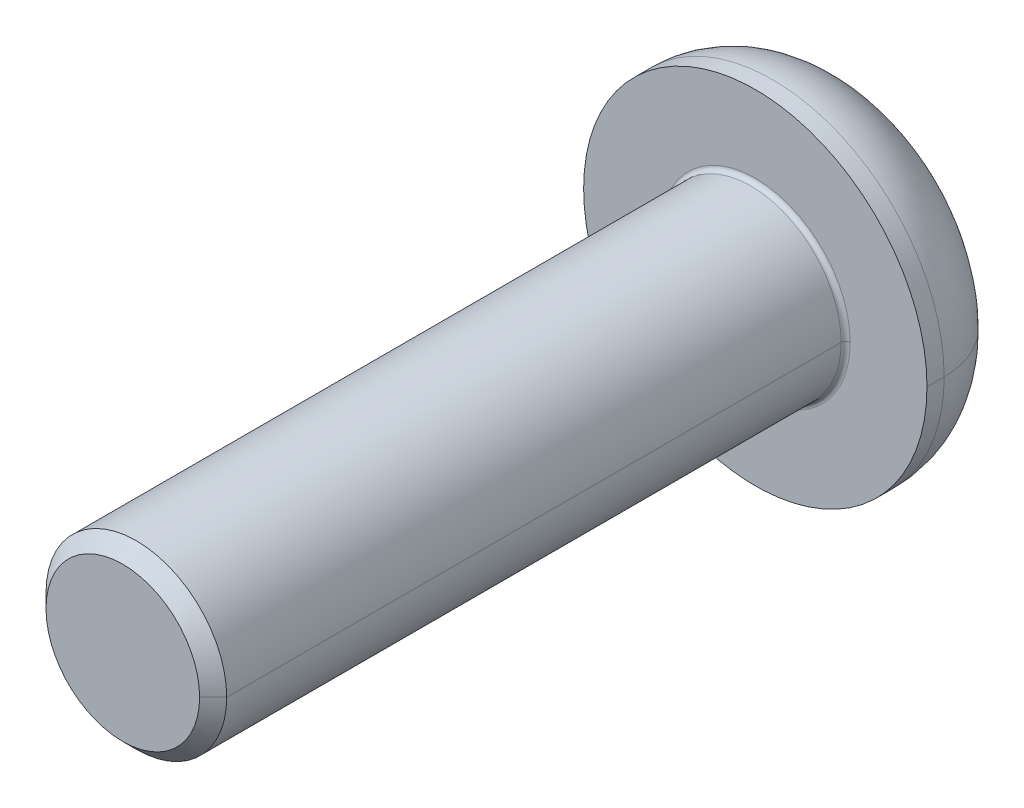
ISO-10303-21;
HEADER;
FILE_DESCRIPTION(('STEP AP214'),'2;1');
FILE_NAME('part.step','',(''),(''),'','','');
FILE_SCHEMA(('AUTOMOTIVE_DESIGN { 1 0 10303 214 1 1 1 1 }'));
ENDSEC;
DATA;
#1=APPLICATION_CONTEXT('core data for automotive mechanical design processes');
#2=APPLICATION_PROTOCOL_DEFINITION('international standard','automotive_design',2000,#1);
#3=PRODUCT_CONTEXT('',#1,'mechanical');
#4=PRODUCT('Part','Part','',(#3));
#5=PRODUCT_RELATED_PRODUCT_CATEGORY('part','',(#4));
#6=PRODUCT_DEFINITION_FORMATION('','',#4);
#7=PRODUCT_DEFINITION_CONTEXT('part definition',#1,'design');
#8=PRODUCT_DEFINITION('design','',#6,#7);
#9=PRODUCT_DEFINITION_SHAPE('','',#8);
#10=(LENGTH_UNIT() NAMED_UNIT(*) SI_UNIT(.MILLI.,.METRE.));
#11=(NAMED_UNIT(*) PLANE_ANGLE_UNIT() SI_UNIT($,.RADIAN.));
#12=(NAMED_UNIT(*) SI_UNIT($,.STERADIAN.) SOLID_ANGLE_UNIT());
#13=UNCERTAINTY_MEASURE_WITH_UNIT(LENGTH_MEASURE(1.E-05),#10,'distance_accuracy_value','');
#14=(GEOMETRIC_REPRESENTATION_CONTEXT(3) GLOBAL_UNCERTAINTY_ASSIGNED_CONTEXT((#13)) GLOBAL_UNIT_ASSIGNED_CONTEXT((#10,
#11,#12)) REPRESENTATION_CONTEXT('',''));
#15=CARTESIAN_POINT('',(0.,0.,0.));
#16=DIRECTION('',(0.,0.,1.));
#17=DIRECTION('',(1.,0.,0.));
#18=AXIS2_PLACEMENT_3D('',#15,#16,#17);
#19=CARTESIAN_POINT('',(0.,0.,0.1));
#20=DIRECTION('',(0.,0.,-1.));
#21=DIRECTION('',(-1.,0.,0.));
#22=AXIS2_PLACEMENT_3D('',#19,#20,#21);
#23=TOROIDAL_SURFACE('',#22,2.1,0.1);
#24=CARTESIAN_POINT('',(2.1,0.,0.1));
#25=DIRECTION('',(0.,1.,0.));
#26=DIRECTION('',(-1.,0.,0.));
#27=AXIS2_PLACEMENT_3D('',#24,#25,#26);
#28=CIRCLE('',#27,0.1);
#29=CARTESIAN_POINT('',(2.1,0.,0.));
#30=VERTEX_POINT('',#29);
#31=CARTESIAN_POINT('',(2.,0.,0.1));
#32=VERTEX_POINT('',#31);
#33=EDGE_CURVE('E296',#30,#32,#28,.T.);
#34=ORIENTED_EDGE('',*,*,#33,.F.);
#35=CARTESIAN_POINT('',(0.,0.,0.));
#36=DIRECTION('',(0.,0.,-1.));
#37=DIRECTION('',(-1.,0.,0.));
#38=AXIS2_PLACEMENT_3D('',#35,#36,#37);
#39=CIRCLE('',#38,2.1);
#40=CARTESIAN_POINT('',(-2.1,0.,0.));
#41=VERTEX_POINT('',#40);
#42=EDGE_CURVE('E232',#41,#30,#39,.T.);
#43=ORIENTED_EDGE('',*,*,#42,.F.);
#44=CARTESIAN_POINT('',(-2.1,0.,0.1));
#45=DIRECTION('',(0.,-1.,0.));
#46=DIRECTION('',(0.,0.,-1.));
#47=AXIS2_PLACEMENT_3D('',#44,#45,#46);
#48=CIRCLE('',#47,0.1);
#49=CARTESIAN_POINT('',(-2.,0.,0.1));
#50=VERTEX_POINT('',#49);
#51=EDGE_CURVE('E309',#41,#50,#48,.T.);
#52=ORIENTED_EDGE('',*,*,#51,.T.);
#53=CARTESIAN_POINT('',(0.,0.,0.1));
#54=DIRECTION('',(0.,0.,1.));
#55=DIRECTION('',(-1.,0.,0.));
#56=AXIS2_PLACEMENT_3D('',#53,#54,#55);
#57=CIRCLE('',#56,2.);
#58=EDGE_CURVE('E189',#32,#50,#57,.T.);
#59=ORIENTED_EDGE('',*,*,#58,.F.);
#60=EDGE_LOOP('',(#34,#43,#52,#59));
#61=FACE_BOUND('',#60,.T.);
#62=ADVANCED_FACE('F17',(#61),#23,.F.);
#63=CARTESIAN_POINT('',(0.,0.,-0.38));
#64=DIRECTION('',(0.,0.,-1.));
#65=DIRECTION('',(-1.,0.,0.));
#66=AXIS2_PLACEMENT_3D('',#63,#64,#65);
#67=TOROIDAL_SURFACE('',#66,1.98,1.82);
#68=CARTESIAN_POINT('',(1.98,0.,-0.38));
#69=DIRECTION('',(0.,1.,0.));
#70=DIRECTION('',(-1.,0.,0.));
#71=AXIS2_PLACEMENT_3D('',#68,#69,#70);
#72=CIRCLE('',#71,1.82);
#73=CARTESIAN_POINT('',(3.8,0.,-0.38));
#74=VERTEX_POINT('',#73);
#75=CARTESIAN_POINT('',(1.98,0.,-2.2));
#76=VERTEX_POINT('',#75);
#77=EDGE_CURVE('E314',#74,#76,#72,.T.);
#78=ORIENTED_EDGE('',*,*,#77,.F.);
#79=CARTESIAN_POINT('',(0.,0.,-0.38));
#80=DIRECTION('',(0.,0.,1.));
#81=DIRECTION('',(-1.,0.,0.));
#82=AXIS2_PLACEMENT_3D('',#79,#80,#81);
#83=CIRCLE('',#82,3.8);
#84=CARTESIAN_POINT('',(-3.8,0.,-0.38));
#85=VERTEX_POINT('',#84);
#86=EDGE_CURVE('E156',#85,#74,#83,.T.);
#87=ORIENTED_EDGE('',*,*,#86,.F.);
#88=CARTESIAN_POINT('',(-1.98,0.,-0.38));
#89=DIRECTION('',(0.,-1.,0.));
#90=DIRECTION('',(0.,0.,-1.));
#91=AXIS2_PLACEMENT_3D('',#88,#89,#90);
#92=CIRCLE('',#91,1.82);
#93=CARTESIAN_POINT('',(-1.98,0.,-2.2));
#94=VERTEX_POINT('',#93);
#95=EDGE_CURVE('E182',#85,#94,#92,.T.);
#96=ORIENTED_EDGE('',*,*,#95,.T.);
#97=CARTESIAN_POINT('',(0.,0.,-2.2));
#98=DIRECTION('',(0.,0.,-1.));
#99=DIRECTION('',(-1.,0.,0.));
#100=AXIS2_PLACEMENT_3D('',#97,#98,#99);
#101=CIRCLE('',#100,1.98);
#102=EDGE_CURVE('E204',#76,#94,#101,.T.);
#103=ORIENTED_EDGE('',*,*,#102,.F.);
#104=EDGE_LOOP('',(#78,#87,#96,#103));
#105=FACE_BOUND('',#104,.T.);
#106=ADVANCED_FACE('F340',(#105),#67,.T.);
#107=CARTESIAN_POINT('',(0.,0.,-0.9));
#108=DIRECTION('',(0.,0.,-1.));
#109=DIRECTION('',(0.,-1.,0.));
#110=AXIS2_PLACEMENT_3D('',#107,#108,#109);
#111=PLANE('',#110);
#112=DIRECTION('',(-1.,0.,0.));
#113=VECTOR('',#112,1.);
#114=CARTESIAN_POINT('',(0.721687836487032,-1.25,-0.9));
#115=LINE('',#114,#113);
#116=CARTESIAN_POINT('',(0.721687836487032,-1.25,-0.9));
#117=VERTEX_POINT('',#116);
#118=CARTESIAN_POINT('',(-0.721687836487032,-1.25,-0.9));
#119=VERTEX_POINT('',#118);
#120=EDGE_CURVE('E194',#117,#119,#115,.T.);
#121=ORIENTED_EDGE('',*,*,#120,.T.);
#122=DIRECTION('',(-0.5,0.866025403784439,0.));
#123=VECTOR('',#122,1.);
#124=CARTESIAN_POINT('',(-0.721687836487032,-1.25,-0.9));
#125=LINE('',#124,#123);
#126=CARTESIAN_POINT('',(-1.44337567297406,0.,-0.9));
#127=VERTEX_POINT('',#126);
#128=EDGE_CURVE('E11',#119,#127,#125,.T.);
#129=ORIENTED_EDGE('',*,*,#128,.T.);
#130=DIRECTION('',(0.5,0.866025403784439,0.));
#131=VECTOR('',#130,1.);
#132=CARTESIAN_POINT('',(-1.44337567297406,0.,-0.9));
#133=LINE('',#132,#131);
#134=CARTESIAN_POINT('',(-0.721687836487033,1.25,-0.9));
#135=VERTEX_POINT('',#134);
#136=EDGE_CURVE('E45',#127,#135,#133,.T.);
#137=ORIENTED_EDGE('',*,*,#136,.T.);
#138=DIRECTION('',(1.,0.,0.));
#139=VECTOR('',#138,1.);
#140=CARTESIAN_POINT('',(-0.721687836487033,1.25,-0.9));
#141=LINE('',#140,#139);
#142=CARTESIAN_POINT('',(0.721687836487032,1.25,-0.9));
#143=VERTEX_POINT('',#142);
#144=EDGE_CURVE('E246',#135,#143,#141,.T.);
#145=ORIENTED_EDGE('',*,*,#144,.T.);
#146=DIRECTION('',(0.5,-0.866025403784439,0.));
#147=VECTOR('',#146,1.);
#148=CARTESIAN_POINT('',(0.721687836487032,1.25,-0.9));
#149=LINE('',#148,#147);
#150=CARTESIAN_POINT('',(1.44337567297406,0.,-0.9));
#151=VERTEX_POINT('',#150);
#152=EDGE_CURVE('E240',#143,#151,#149,.T.);
#153=ORIENTED_EDGE('',*,*,#152,.T.);
#154=DIRECTION('',(-0.5,-0.866025403784439,0.));
#155=VECTOR('',#154,1.);
#156=CARTESIAN_POINT('',(1.44337567297406,0.,-0.9));
#157=LINE('',#156,#155);
#158=EDGE_CURVE('E208',#151,#117,#157,.T.);
#159=ORIENTED_EDGE('',*,*,#158,.T.);
#160=EDGE_LOOP('',(#121,#129,#137,#145,#153,#159));
#161=FACE_BOUND('',#160,.T.);
#162=ADVANCED_FACE('F276',(#161),#111,.T.);
#163=CARTESIAN_POINT('',(-0.721687836487032,-1.25,-0.9));
#164=DIRECTION('',(-0.866025403784439,-0.5,0.));
#165=DIRECTION('',(-0.5,0.866025403784439,0.));
#166=AXIS2_PLACEMENT_3D('',#163,#164,#165);
#167=PLANE('',#166);
#168=DIRECTION('',(-0.5,0.866025403784439,0.));
#169=VECTOR('',#168,1.);
#170=CARTESIAN_POINT('',(-0.721687836487032,-1.25,-2.2));
#171=LINE('',#170,#169);
#172=CARTESIAN_POINT('',(-0.721687836487032,-1.25,-2.2));
#173=VERTEX_POINT('',#172);
#174=CARTESIAN_POINT('',(-1.44337567297406,0.,-2.2));
#175=VERTEX_POINT('',#174);
#176=EDGE_CURVE('E228',#173,#175,#171,.T.);
#177=ORIENTED_EDGE('',*,*,#176,.T.);
#178=DIRECTION('',(0.,0.,-1.));
#179=VECTOR('',#178,1.);
#180=CARTESIAN_POINT('',(-1.44337567297406,0.,-0.9));
#181=LINE('',#180,#179);
#182=EDGE_CURVE('E20',#127,#175,#181,.T.);
#183=ORIENTED_EDGE('',*,*,#182,.F.);
#184=ORIENTED_EDGE('',*,*,#128,.F.);
#185=DIRECTION('',(0.,0.,-1.));
#186=VECTOR('',#185,1.);
#187=CARTESIAN_POINT('',(-0.721687836487032,-1.25,-0.9));
#188=LINE('',#187,#186);
#189=EDGE_CURVE('E198',#119,#173,#188,.T.);
#190=ORIENTED_EDGE('',*,*,#189,.T.);
#191=EDGE_LOOP('',(#177,#183,#184,#190));
#192=FACE_BOUND('',#191,.T.);
#193=ADVANCED_FACE('F263',(#192),#167,.F.);
#194=CARTESIAN_POINT('',(-1.44337567297406,0.,-0.9));
#195=DIRECTION('',(-0.866025403784439,0.5,0.));
#196=DIRECTION('',(0.,0.,1.));
#197=AXIS2_PLACEMENT_3D('',#194,#195,#196);
#198=PLANE('',#197);
#199=DIRECTION('',(0.5,0.866025403784439,0.));
#200=VECTOR('',#199,1.);
#201=CARTESIAN_POINT('',(-1.44337567297406,0.,-2.2));
#202=LINE('',#201,#200);
#203=CARTESIAN_POINT('',(-0.721687836487033,1.25,-2.2));
#204=VERTEX_POINT('',#203);
#205=EDGE_CURVE('E224',#175,#204,#202,.T.);
#206=ORIENTED_EDGE('',*,*,#205,.T.);
#207=DIRECTION('',(0.,0.,-1.));
#208=VECTOR('',#207,1.);
#209=CARTESIAN_POINT('',(-0.721687836487033,1.25,-0.9));
#210=LINE('',#209,#208);
#211=EDGE_CURVE('E249',#135,#204,#210,.T.);
#212=ORIENTED_EDGE('',*,*,#211,.F.);
#213=ORIENTED_EDGE('',*,*,#136,.F.);
#214=ORIENTED_EDGE('',*,*,#182,.T.);
#215=EDGE_LOOP('',(#206,#212,#213,#214));
#216=FACE_BOUND('',#215,.T.);
#217=ADVANCED_FACE('F258',(#216),#198,.F.);
#218=CARTESIAN_POINT('',(-0.721687836487033,1.25,-0.9));
#219=DIRECTION('',(0.,1.,0.));
#220=DIRECTION('',(1.,0.,0.));
#221=AXIS2_PLACEMENT_3D('',#218,#219,#220);
#222=PLANE('',#221);
#223=DIRECTION('',(1.,0.,0.));
#224=VECTOR('',#223,1.);
#225=CARTESIAN_POINT('',(-0.721687836487033,1.25,-2.2));
#226=LINE('',#225,#224);
#227=CARTESIAN_POINT('',(0.721687836487032,1.25,-2.2));
#228=VERTEX_POINT('',#227);
#229=EDGE_CURVE('E220',#204,#228,#226,.T.);
#230=ORIENTED_EDGE('',*,*,#229,.T.);
#231=DIRECTION('',(0.,0.,-1.));
#232=VECTOR('',#231,1.);
#233=CARTESIAN_POINT('',(0.721687836487032,1.25,-0.9));
#234=LINE('',#233,#232);
#235=EDGE_CURVE('E243',#143,#228,#234,.T.);
#236=ORIENTED_EDGE('',*,*,#235,.F.);
#237=ORIENTED_EDGE('',*,*,#144,.F.);
#238=ORIENTED_EDGE('',*,*,#211,.T.);
#239=EDGE_LOOP('',(#230,#236,#237,#238));
#240=FACE_BOUND('',#239,.T.);
#241=ADVANCED_FACE('F273',(#240),#222,.F.);
#242=CARTESIAN_POINT('',(0.721687836487032,1.25,-0.9));
#243=DIRECTION('',(0.866025403784439,0.5,0.));
#244=DIRECTION('',(0.,0.,-1.));
#245=AXIS2_PLACEMENT_3D('',#242,#243,#244);
#246=PLANE('',#245);
#247=DIRECTION('',(0.5,-0.866025403784439,0.));
#248=VECTOR('',#247,1.);
#249=CARTESIAN_POINT('',(0.721687836487032,1.25,-2.2));
#250=LINE('',#249,#248);
#251=CARTESIAN_POINT('',(1.44337567297406,0.,-2.2));
#252=VERTEX_POINT('',#251);
#253=EDGE_CURVE('E216',#228,#252,#250,.T.);
#254=ORIENTED_EDGE('',*,*,#253,.T.);
#255=DIRECTION('',(0.,0.,-1.));
#256=VECTOR('',#255,1.);
#257=CARTESIAN_POINT('',(1.44337567297406,0.,-0.9));
#258=LINE('',#257,#256);
#259=EDGE_CURVE('E237',#151,#252,#258,.T.);
#260=ORIENTED_EDGE('',*,*,#259,.F.);
#261=ORIENTED_EDGE('',*,*,#152,.F.);
#262=ORIENTED_EDGE('',*,*,#235,.T.);
#263=EDGE_LOOP('',(#254,#260,#261,#262));
#264=FACE_BOUND('',#263,.T.);
#265=ADVANCED_FACE('F281',(#264),#246,.F.);
#266=CARTESIAN_POINT('',(1.44337567297406,0.,-0.9));
#267=DIRECTION('',(0.866025403784439,-0.5,0.));
#268=DIRECTION('',(0.,0.,-1.));
#269=AXIS2_PLACEMENT_3D('',#266,#267,#268);
#270=PLANE('',#269);
#271=DIRECTION('',(-0.5,-0.866025403784439,0.));
#272=VECTOR('',#271,1.);
#273=CARTESIAN_POINT('',(1.44337567297406,0.,-2.2));
#274=LINE('',#273,#272);
#275=CARTESIAN_POINT('',(0.721687836487032,-1.25,-2.2));
#276=VERTEX_POINT('',#275);
#277=EDGE_CURVE('E215',#252,#276,#274,.T.);
#278=ORIENTED_EDGE('',*,*,#277,.T.);
#279=DIRECTION('',(0.,0.,-1.));
#280=VECTOR('',#279,1.);
#281=CARTESIAN_POINT('',(0.721687836487032,-1.25,-0.9));
#282=LINE('',#281,#280);
#283=EDGE_CURVE('E197',#117,#276,#282,.T.);
#284=ORIENTED_EDGE('',*,*,#283,.F.);
#285=ORIENTED_EDGE('',*,*,#158,.F.);
#286=ORIENTED_EDGE('',*,*,#259,.T.);
#287=EDGE_LOOP('',(#278,#284,#285,#286));
#288=FACE_BOUND('',#287,.T.);
#289=ADVANCED_FACE('F284',(#288),#270,.F.);
#290=CARTESIAN_POINT('',(0.721687836487032,-1.25,-0.9));
#291=DIRECTION('',(0.,-1.,0.));
#292=DIRECTION('',(-1.,0.,0.));
#293=AXIS2_PLACEMENT_3D('',#290,#291,#292);
#294=PLANE('',#293);
#295=DIRECTION('',(-1.,0.,0.));
#296=VECTOR('',#295,1.);
#297=CARTESIAN_POINT('',(0.721687836487032,-1.25,-2.2));
#298=LINE('',#297,#296);
#299=EDGE_CURVE('E211',#276,#173,#298,.T.);
#300=ORIENTED_EDGE('',*,*,#299,.T.);
#301=ORIENTED_EDGE('',*,*,#189,.F.);
#302=ORIENTED_EDGE('',*,*,#120,.F.);
#303=ORIENTED_EDGE('',*,*,#283,.T.);
#304=EDGE_LOOP('',(#300,#301,#302,#303));
#305=FACE_BOUND('',#304,.T.);
#306=ADVANCED_FACE('F287',(#305),#294,.F.);
#307=CARTESIAN_POINT('',(0.,0.,0.));
#308=DIRECTION('',(0.,0.,-1.));
#309=DIRECTION('',(0.,-1.,0.));
#310=AXIS2_PLACEMENT_3D('',#307,#308,#309);
#311=PLANE('',#310);
#312=ORIENTED_EDGE('',*,*,#42,.T.);
#313=CARTESIAN_POINT('',(0.,0.,0.));
#314=DIRECTION('',(0.,0.,-1.));
#315=DIRECTION('',(-1.,0.,0.));
#316=AXIS2_PLACEMENT_3D('',#313,#314,#315);
#317=CIRCLE('',#316,2.1);
#318=EDGE_CURVE('E301',#30,#41,#317,.T.);
#319=ORIENTED_EDGE('',*,*,#318,.T.);
#320=EDGE_LOOP('',(#312,#319));
#321=FACE_BOUND('',#320,.T.);
#322=CARTESIAN_POINT('',(0.,0.,0.));
#323=DIRECTION('',(0.,0.,-1.));
#324=DIRECTION('',(-1.,0.,0.));
#325=AXIS2_PLACEMENT_3D('',#322,#323,#324);
#326=CIRCLE('',#325,3.8);
#327=CARTESIAN_POINT('',(3.8,0.,0.));
#328=VERTEX_POINT('',#327);
#329=CARTESIAN_POINT('',(-3.8,0.,0.));
#330=VERTEX_POINT('',#329);
#331=EDGE_CURVE('E185',#328,#330,#326,.T.);
#332=ORIENTED_EDGE('',*,*,#331,.F.);
#333=CARTESIAN_POINT('',(0.,0.,0.));
#334=DIRECTION('',(0.,0.,-1.));
#335=DIRECTION('',(-1.,0.,0.));
#336=AXIS2_PLACEMENT_3D('',#333,#334,#335);
#337=CIRCLE('',#336,3.8);
#338=EDGE_CURVE('E178',#330,#328,#337,.T.);
#339=ORIENTED_EDGE('',*,*,#338,.F.);
#340=EDGE_LOOP('',(#332,#339));
#341=FACE_BOUND('',#340,.T.);
#342=ADVANCED_FACE('F396',(#321,#341),#311,.F.);
#343=CARTESIAN_POINT('',(0.,0.,-2.2));
#344=DIRECTION('',(0.,0.,-1.));
#345=DIRECTION('',(0.,-1.,0.));
#346=AXIS2_PLACEMENT_3D('',#343,#344,#345);
#347=PLANE('',#346);
#348=ORIENTED_EDGE('',*,*,#299,.F.);
#349=ORIENTED_EDGE('',*,*,#277,.F.);
#350=ORIENTED_EDGE('',*,*,#253,.F.);
#351=ORIENTED_EDGE('',*,*,#229,.F.);
#352=ORIENTED_EDGE('',*,*,#205,.F.);
#353=ORIENTED_EDGE('',*,*,#176,.F.);
#354=EDGE_LOOP('',(#348,#349,#350,#351,#352,#353));
#355=FACE_BOUND('',#354,.T.);
#356=CARTESIAN_POINT('',(0.,0.,-2.2));
#357=DIRECTION('',(0.,0.,-1.));
#358=DIRECTION('',(-1.,0.,0.));
#359=AXIS2_PLACEMENT_3D('',#356,#357,#358);
#360=CIRCLE('',#359,1.98);
#361=EDGE_CURVE('E294',#94,#76,#360,.T.);
#362=ORIENTED_EDGE('',*,*,#361,.T.);
#363=ORIENTED_EDGE('',*,*,#102,.T.);
#364=EDGE_LOOP('',(#362,#363));
#365=FACE_BOUND('',#364,.T.);
#366=ADVANCED_FACE('F267',(#355,#365),#347,.T.);
#367=CARTESIAN_POINT('',(0.,0.,-2.2));
#368=DIRECTION('',(0.,0.,1.));
#369=DIRECTION('',(1.,0.,0.));
#370=AXIS2_PLACEMENT_3D('',#367,#368,#369);
#371=CYLINDRICAL_SURFACE('',#370,3.8);
#372=DIRECTION('',(0.,0.,1.));
#373=VECTOR('',#372,1.);
#374=CARTESIAN_POINT('',(-3.8,0.,-2.2));
#375=LINE('',#374,#373);
#376=EDGE_CURVE('E302',#85,#330,#375,.T.);
#377=ORIENTED_EDGE('',*,*,#376,.F.);
#378=ORIENTED_EDGE('',*,*,#86,.T.);
#379=DIRECTION('',(0.,0.,1.));
#380=VECTOR('',#379,1.);
#381=CARTESIAN_POINT('',(3.8,0.,-2.2));
#382=LINE('',#381,#380);
#383=EDGE_CURVE('E169',#74,#328,#382,.T.);
#384=ORIENTED_EDGE('',*,*,#383,.T.);
#385=ORIENTED_EDGE('',*,*,#331,.T.);
#386=EDGE_LOOP('',(#377,#378,#384,#385));
#387=FACE_BOUND('',#386,.T.);
#388=ADVANCED_FACE('F395',(#387),#371,.T.);
#389=CARTESIAN_POINT('',(0.,0.,14.));
#390=DIRECTION('',(0.,0.,-1.));
#391=DIRECTION('',(-1.,0.,0.));
#392=AXIS2_PLACEMENT_3D('',#389,#390,#391);
#393=CONICAL_SURFACE('',#392,1.7,0.785398163397446);
#394=DIRECTION('',(0.707106781186546,0.,-0.70710678118655));
#395=VECTOR('',#394,1.);
#396=CARTESIAN_POINT('',(1.7,0.,14.));
#397=LINE('',#396,#395);
#398=CARTESIAN_POINT('',(1.7,0.,14.));
#399=VERTEX_POINT('',#398);
#400=CARTESIAN_POINT('',(2.,0.,13.7));
#401=VERTEX_POINT('',#400);
#402=EDGE_CURVE('E151',#399,#401,#397,.T.);
#403=ORIENTED_EDGE('',*,*,#402,.F.);
#404=CARTESIAN_POINT('',(0.,0.,14.));
#405=DIRECTION('',(0.,0.,1.));
#406=DIRECTION('',(1.,0.,0.));
#407=AXIS2_PLACEMENT_3D('',#404,#405,#406);
#408=CIRCLE('',#407,1.7);
#409=CARTESIAN_POINT('',(-1.7,0.,14.));
#410=VERTEX_POINT('',#409);
#411=EDGE_CURVE('E145',#410,#399,#408,.T.);
#412=ORIENTED_EDGE('',*,*,#411,.F.);
#413=DIRECTION('',(-0.707106781186546,0.,-0.70710678118655));
#414=VECTOR('',#413,1.);
#415=CARTESIAN_POINT('',(-1.7,0.,14.));
#416=LINE('',#415,#414);
#417=CARTESIAN_POINT('',(-2.,0.,13.7));
#418=VERTEX_POINT('',#417);
#419=EDGE_CURVE('E148',#410,#418,#416,.T.);
#420=ORIENTED_EDGE('',*,*,#419,.T.);
#421=CARTESIAN_POINT('',(0.,0.,13.7));
#422=DIRECTION('',(0.,0.,-1.));
#423=DIRECTION('',(1.,0.,0.));
#424=AXIS2_PLACEMENT_3D('',#421,#422,#423);
#425=CIRCLE('',#424,2.);
#426=EDGE_CURVE('E157',#401,#418,#425,.T.);
#427=ORIENTED_EDGE('',*,*,#426,.F.);
#428=EDGE_LOOP('',(#403,#412,#420,#427));
#429=FACE_BOUND('',#428,.T.);
#430=ADVANCED_FACE('F147',(#429),#393,.T.);
#431=CARTESIAN_POINT('',(0.,0.,14.));
#432=DIRECTION('',(0.,0.,1.));
#433=DIRECTION('',(1.,0.,0.));
#434=AXIS2_PLACEMENT_3D('',#431,#432,#433);
#435=PLANE('',#434);
#436=ORIENTED_EDGE('',*,*,#411,.T.);
#437=CARTESIAN_POINT('',(0.,0.,14.));
#438=DIRECTION('',(0.,0.,1.));
#439=DIRECTION('',(1.,0.,0.));
#440=AXIS2_PLACEMENT_3D('',#437,#438,#439);
#441=CIRCLE('',#440,1.7);
#442=EDGE_CURVE('E161',#399,#410,#441,.T.);
#443=ORIENTED_EDGE('',*,*,#442,.T.);
#444=EDGE_LOOP('',(#436,#443));
#445=FACE_BOUND('',#444,.T.);
#446=ADVANCED_FACE('F167',(#445),#435,.T.);
#447=CARTESIAN_POINT('',(0.,0.,14.));
#448=DIRECTION('',(0.,0.,-1.));
#449=DIRECTION('',(-1.,0.,0.));
#450=AXIS2_PLACEMENT_3D('',#447,#448,#449);
#451=CYLINDRICAL_SURFACE('',#450,2.);
#452=DIRECTION('',(0.,0.,-1.));
#453=VECTOR('',#452,1.);
#454=CARTESIAN_POINT('',(2.,0.,14.));
#455=LINE('',#454,#453);
#456=EDGE_CURVE('E165',#401,#32,#455,.T.);
#457=ORIENTED_EDGE('',*,*,#456,.F.);
#458=ORIENTED_EDGE('',*,*,#426,.T.);
#459=DIRECTION('',(0.,0.,-1.));
#460=VECTOR('',#459,1.);
#461=CARTESIAN_POINT('',(-2.,0.,14.));
#462=LINE('',#461,#460);
#463=EDGE_CURVE('E193',#418,#50,#462,.T.);
#464=ORIENTED_EDGE('',*,*,#463,.T.);
#465=CARTESIAN_POINT('',(0.,0.,0.1));
#466=DIRECTION('',(0.,0.,1.));
#467=DIRECTION('',(-1.,0.,0.));
#468=AXIS2_PLACEMENT_3D('',#465,#466,#467);
#469=CIRCLE('',#468,2.);
#470=EDGE_CURVE('E300',#50,#32,#469,.T.);
#471=ORIENTED_EDGE('',*,*,#470,.T.);
#472=EDGE_LOOP('',(#457,#458,#464,#471));
#473=FACE_BOUND('',#472,.T.);
#474=ADVANCED_FACE('F379',(#473),#451,.T.);
#475=CARTESIAN_POINT('',(0.,0.,14.));
#476=DIRECTION('',(0.,0.,-1.));
#477=DIRECTION('',(-1.,0.,0.));
#478=AXIS2_PLACEMENT_3D('',#475,#476,#477);
#479=CYLINDRICAL_SURFACE('',#478,2.);
#480=CARTESIAN_POINT('',(0.,0.,13.7));
#481=DIRECTION('',(0.,0.,-1.));
#482=DIRECTION('',(1.,0.,0.));
#483=AXIS2_PLACEMENT_3D('',#480,#481,#482);
#484=CIRCLE('',#483,2.);
#485=EDGE_CURVE('E163',#418,#401,#484,.T.);
#486=ORIENTED_EDGE('',*,*,#485,.T.);
#487=ORIENTED_EDGE('',*,*,#456,.T.);
#488=ORIENTED_EDGE('',*,*,#58,.T.);
#489=ORIENTED_EDGE('',*,*,#463,.F.);
#490=EDGE_LOOP('',(#486,#487,#488,#489));
#491=FACE_BOUND('',#490,.T.);
#492=ADVANCED_FACE('F382',(#491),#479,.T.);
#493=CARTESIAN_POINT('',(0.,0.,14.));
#494=DIRECTION('',(0.,0.,-1.));
#495=DIRECTION('',(-1.,0.,0.));
#496=AXIS2_PLACEMENT_3D('',#493,#494,#495);
#497=CONICAL_SURFACE('',#496,1.7,0.785398163397446);
#498=ORIENTED_EDGE('',*,*,#442,.F.);
#499=ORIENTED_EDGE('',*,*,#402,.T.);
#500=ORIENTED_EDGE('',*,*,#485,.F.);
#501=ORIENTED_EDGE('',*,*,#419,.F.);
#502=EDGE_LOOP('',(#498,#499,#500,#501));
#503=FACE_BOUND('',#502,.T.);
#504=ADVANCED_FACE('F160',(#503),#497,.T.);
#505=CARTESIAN_POINT('',(0.,0.,-2.2));
#506=DIRECTION('',(0.,0.,1.));
#507=DIRECTION('',(1.,0.,0.));
#508=AXIS2_PLACEMENT_3D('',#505,#506,#507);
#509=CYLINDRICAL_SURFACE('',#508,3.8);
#510=CARTESIAN_POINT('',(0.,0.,-0.38));
#511=DIRECTION('',(0.,0.,1.));
#512=DIRECTION('',(-1.,0.,0.));
#513=AXIS2_PLACEMENT_3D('',#510,#511,#512);
#514=CIRCLE('',#513,3.8);
#515=EDGE_CURVE('E310',#74,#85,#514,.T.);
#516=ORIENTED_EDGE('',*,*,#515,.T.);
#517=ORIENTED_EDGE('',*,*,#376,.T.);
#518=ORIENTED_EDGE('',*,*,#338,.T.);
#519=ORIENTED_EDGE('',*,*,#383,.F.);
#520=EDGE_LOOP('',(#516,#517,#518,#519));
#521=FACE_BOUND('',#520,.T.);
#522=ADVANCED_FACE('F345',(#521),#509,.T.);
#523=CARTESIAN_POINT('',(0.,0.,-0.38));
#524=DIRECTION('',(0.,0.,-1.));
#525=DIRECTION('',(-1.,0.,0.));
#526=AXIS2_PLACEMENT_3D('',#523,#524,#525);
#527=TOROIDAL_SURFACE('',#526,1.98,1.82);
#528=ORIENTED_EDGE('',*,*,#515,.F.);
#529=ORIENTED_EDGE('',*,*,#77,.T.);
#530=ORIENTED_EDGE('',*,*,#361,.F.);
#531=ORIENTED_EDGE('',*,*,#95,.F.);
#532=EDGE_LOOP('',(#528,#529,#530,#531));
#533=FACE_BOUND('',#532,.T.);
#534=ADVANCED_FACE('F342',(#533),#527,.T.);
#535=CARTESIAN_POINT('',(0.,0.,0.1));
#536=DIRECTION('',(0.,0.,-1.));
#537=DIRECTION('',(-1.,0.,0.));
#538=AXIS2_PLACEMENT_3D('',#535,#536,#537);
#539=TOROIDAL_SURFACE('',#538,2.1,0.1);
#540=ORIENTED_EDGE('',*,*,#318,.F.);
#541=ORIENTED_EDGE('',*,*,#33,.T.);
#542=ORIENTED_EDGE('',*,*,#470,.F.);
#543=ORIENTED_EDGE('',*,*,#51,.F.);
#544=EDGE_LOOP('',(#540,#541,#542,#543));
#545=FACE_BOUND('',#544,.T.);
#546=ADVANCED_FACE('F344',(#545),#539,.F.);
#547=CLOSED_SHELL('',(#62,#106,#162,#193,#217,#241,#265,#289,#306,#342,#366,#388,#430,#446,#474,
#492,#504,#522,#534,#546));
#548=MANIFOLD_SOLID_BREP('B1',#547);
#549=ADVANCED_BREP_SHAPE_REPRESENTATION('',(#18,#548),#14);
#550=SHAPE_DEFINITION_REPRESENTATION(#9,#549);
ENDSEC;
END-ISO-10303-21;
